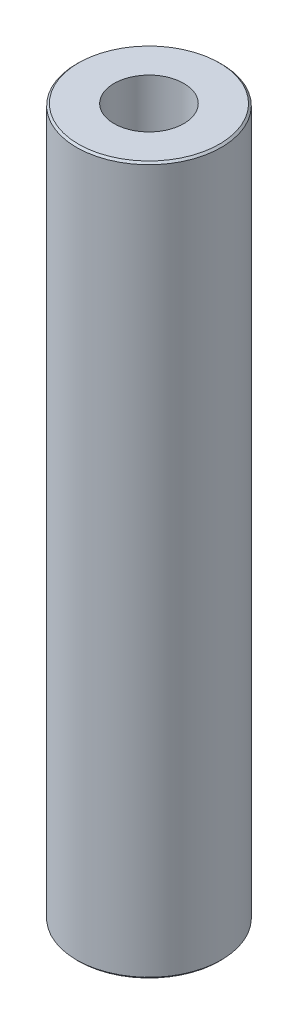
ISO-10303-21;
HEADER;
FILE_DESCRIPTION(('STEP AP214'),'2;1');
FILE_NAME('part.step','',(''),(''),'','','');
FILE_SCHEMA(('AUTOMOTIVE_DESIGN { 1 0 10303 214 1 1 1 1 }'));
ENDSEC;
DATA;
#1=APPLICATION_CONTEXT('core data for automotive mechanical design processes');
#2=APPLICATION_PROTOCOL_DEFINITION('international standard','automotive_design',2000,#1);
#3=PRODUCT_CONTEXT('',#1,'mechanical');
#4=PRODUCT('Part','Part','',(#3));
#5=PRODUCT_RELATED_PRODUCT_CATEGORY('part','',(#4));
#6=PRODUCT_DEFINITION_FORMATION('','',#4);
#7=PRODUCT_DEFINITION_CONTEXT('part definition',#1,'design');
#8=PRODUCT_DEFINITION('design','',#6,#7);
#9=PRODUCT_DEFINITION_SHAPE('','',#8);
#10=(LENGTH_UNIT() NAMED_UNIT(*) SI_UNIT(.MILLI.,.METRE.));
#11=(NAMED_UNIT(*) PLANE_ANGLE_UNIT() SI_UNIT($,.RADIAN.));
#12=(NAMED_UNIT(*) SI_UNIT($,.STERADIAN.) SOLID_ANGLE_UNIT());
#13=UNCERTAINTY_MEASURE_WITH_UNIT(LENGTH_MEASURE(1.E-05),#10,'distance_accuracy_value','');
#14=(GEOMETRIC_REPRESENTATION_CONTEXT(3) GLOBAL_UNCERTAINTY_ASSIGNED_CONTEXT((#13)) GLOBAL_UNIT_ASSIGNED_CONTEXT((#10,
#11,#12)) REPRESENTATION_CONTEXT('',''));
#15=CARTESIAN_POINT('',(0.,0.,0.));
#16=DIRECTION('',(0.,0.,1.));
#17=DIRECTION('',(1.,0.,0.));
#18=AXIS2_PLACEMENT_3D('',#15,#16,#17);
#19=CARTESIAN_POINT('',(0.,561.933998689714,0.));
#20=DIRECTION('',(0.,-1.,0.));
#21=DIRECTION('',(0.,0.,-1.));
#22=AXIS2_PLACEMENT_3D('',#19,#20,#21);
#23=CYLINDRICAL_SURFACE('',#22,57.5);
#24=CARTESIAN_POINT('',(0.,560.467016032164,0.));
#25=DIRECTION('',(0.,1.,0.));
#26=DIRECTION('',(0.,0.,1.));
#27=AXIS2_PLACEMENT_3D('',#24,#25,#26);
#28=CIRCLE('',#27,57.5);
#29=CARTESIAN_POINT('',(0.,560.467016032164,57.5));
#30=VERTEX_POINT('',#29);
#31=EDGE_CURVE('E50',#30,#30,#28,.F.);
#32=ORIENTED_EDGE('',*,*,#31,.T.);
#33=EDGE_LOOP('',(#32));
#34=FACE_BOUND('',#33,.T.);
#35=CARTESIAN_POINT('',(0.,1.54722568726751,0.));
#36=DIRECTION('',(0.,1.,0.));
#37=DIRECTION('',(0.,0.,1.));
#38=AXIS2_PLACEMENT_3D('',#35,#36,#37);
#39=CIRCLE('',#38,57.5);
#40=CARTESIAN_POINT('',(0.,1.54722568726751,57.5));
#41=VERTEX_POINT('',#40);
#42=EDGE_CURVE('E51',#41,#41,#39,.T.);
#43=ORIENTED_EDGE('',*,*,#42,.T.);
#44=EDGE_LOOP('',(#43));
#45=FACE_BOUND('',#44,.T.);
#46=ADVANCED_FACE('F39',(#34,#45),#23,.T.);
#47=CARTESIAN_POINT('',(0.,561.933998689714,0.));
#48=DIRECTION('',(0.,1.,0.));
#49=DIRECTION('',(0.,0.,1.));
#50=AXIS2_PLACEMENT_3D('',#47,#48,#49);
#51=PLANE('',#50);
#52=CARTESIAN_POINT('',(0.,561.933998689714,0.));
#53=DIRECTION('',(0.,1.,0.));
#54=DIRECTION('',(0.,0.,1.));
#55=AXIS2_PLACEMENT_3D('',#52,#53,#54);
#56=CIRCLE('',#55,55.9527743127325);
#57=CARTESIAN_POINT('',(0.,561.933998689714,55.9527743127325));
#58=VERTEX_POINT('',#57);
#59=EDGE_CURVE('E54',#58,#58,#56,.T.);
#60=ORIENTED_EDGE('',*,*,#59,.T.);
#61=EDGE_LOOP('',(#60));
#62=FACE_BOUND('',#61,.T.);
#63=CARTESIAN_POINT('',(0.,561.933998689714,0.));
#64=DIRECTION('',(0.,1.,0.));
#65=DIRECTION('',(0.,0.,1.));
#66=AXIS2_PLACEMENT_3D('',#63,#64,#65);
#67=CIRCLE('',#66,27.7017210463026);
#68=CARTESIAN_POINT('',(0.,561.933998689714,27.7017210463026));
#69=VERTEX_POINT('',#68);
#70=EDGE_CURVE('E58',#69,#69,#67,.T.);
#71=ORIENTED_EDGE('',*,*,#70,.F.);
#72=EDGE_LOOP('',(#71));
#73=FACE_BOUND('',#72,.T.);
#74=ADVANCED_FACE('F69',(#62,#73),#51,.T.);
#75=CARTESIAN_POINT('',(0.,0.,0.));
#76=DIRECTION('',(0.,1.,0.));
#77=DIRECTION('',(0.,0.,1.));
#78=AXIS2_PLACEMENT_3D('',#75,#76,#77);
#79=PLANE('',#78);
#80=CARTESIAN_POINT('',(0.,0.,0.));
#81=DIRECTION('',(0.,1.,0.));
#82=DIRECTION('',(0.,0.,1.));
#83=AXIS2_PLACEMENT_3D('',#80,#81,#82);
#84=CIRCLE('',#83,56.0330173424498);
#85=CARTESIAN_POINT('',(0.,0.,56.0330173424498));
#86=VERTEX_POINT('',#85);
#87=EDGE_CURVE('E10',#86,#86,#84,.F.);
#88=ORIENTED_EDGE('',*,*,#87,.T.);
#89=EDGE_LOOP('',(#88));
#90=FACE_BOUND('',#89,.T.);
#91=CARTESIAN_POINT('',(0.,0.,0.));
#92=DIRECTION('',(0.,1.,0.));
#93=DIRECTION('',(0.,0.,1.));
#94=AXIS2_PLACEMENT_3D('',#91,#92,#93);
#95=CIRCLE('',#94,27.7017210463026);
#96=CARTESIAN_POINT('',(0.,0.,27.7017210463026));
#97=VERTEX_POINT('',#96);
#98=EDGE_CURVE('E63',#97,#97,#95,.T.);
#99=ORIENTED_EDGE('',*,*,#98,.T.);
#100=EDGE_LOOP('',(#99));
#101=FACE_BOUND('',#100,.T.);
#102=ADVANCED_FACE('F75',(#90,#101),#79,.F.);
#103=CARTESIAN_POINT('',(0.,561.933998689714,0.));
#104=DIRECTION('',(0.,-1.,0.));
#105=DIRECTION('',(0.,0.,-1.));
#106=AXIS2_PLACEMENT_3D('',#103,#104,#105);
#107=CYLINDRICAL_SURFACE('',#106,27.7017210463026);
#108=ORIENTED_EDGE('',*,*,#70,.T.);
#109=EDGE_LOOP('',(#108));
#110=FACE_BOUND('',#109,.T.);
#111=ORIENTED_EDGE('',*,*,#98,.F.);
#112=EDGE_LOOP('',(#111));
#113=FACE_BOUND('',#112,.T.);
#114=ADVANCED_FACE('F70',(#110,#113),#107,.F.);
#115=CARTESIAN_POINT('',(0.,561.933998689714,0.));
#116=DIRECTION('',(0.,-1.,0.));
#117=DIRECTION('',(0.,0.,-1.));
#118=AXIS2_PLACEMENT_3D('',#115,#116,#117);
#119=CONICAL_SURFACE('',#118,55.9527743127325,0.812013470725517);
#120=ORIENTED_EDGE('',*,*,#31,.F.);
#121=EDGE_LOOP('',(#120));
#122=FACE_BOUND('',#121,.T.);
#123=ORIENTED_EDGE('',*,*,#59,.F.);
#124=EDGE_LOOP('',(#123));
#125=FACE_BOUND('',#124,.T.);
#126=ADVANCED_FACE('F81',(#122,#125),#119,.T.);
#127=CARTESIAN_POINT('',(0.,1.54722568726751,0.));
#128=DIRECTION('',(0.,1.,0.));
#129=DIRECTION('',(0.,0.,1.));
#130=AXIS2_PLACEMENT_3D('',#127,#128,#129);
#131=CONICAL_SURFACE('',#130,57.5,0.758782856069385);
#132=ORIENTED_EDGE('',*,*,#87,.F.);
#133=EDGE_LOOP('',(#132));
#134=FACE_BOUND('',#133,.T.);
#135=ORIENTED_EDGE('',*,*,#42,.F.);
#136=EDGE_LOOP('',(#135));
#137=FACE_BOUND('',#136,.T.);
#138=ADVANCED_FACE('F45',(#134,#137),#131,.T.);
#139=CLOSED_SHELL('',(#46,#74,#102,#114,#126,#138));
#140=MANIFOLD_SOLID_BREP('B2',#139);
#141=ADVANCED_BREP_SHAPE_REPRESENTATION('',(#18,#140),#14);
#142=SHAPE_DEFINITION_REPRESENTATION(#9,#141);
ENDSEC;
END-ISO-10303-21;
